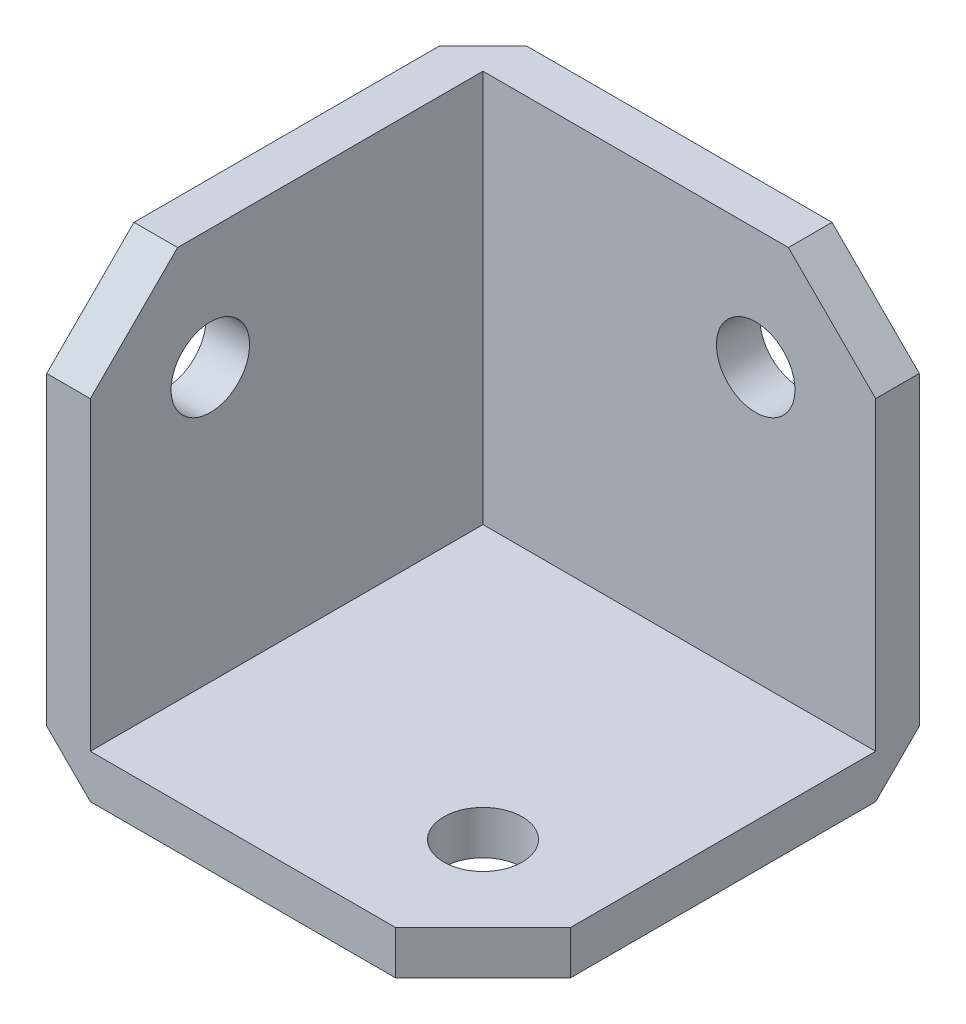
ISO-10303-21;
HEADER;
FILE_DESCRIPTION(('STEP AP214'),'2;1');
FILE_NAME('part.step','',(''),(''),'','','');
FILE_SCHEMA(('AUTOMOTIVE_DESIGN { 1 0 10303 214 1 1 1 1 }'));
ENDSEC;
DATA;
#1=APPLICATION_CONTEXT('core data for automotive mechanical design processes');
#2=APPLICATION_PROTOCOL_DEFINITION('international standard','automotive_design',2000,#1);
#3=PRODUCT_CONTEXT('',#1,'mechanical');
#4=PRODUCT('Part','Part','',(#3));
#5=PRODUCT_RELATED_PRODUCT_CATEGORY('part','',(#4));
#6=PRODUCT_DEFINITION_FORMATION('','',#4);
#7=PRODUCT_DEFINITION_CONTEXT('part definition',#1,'design');
#8=PRODUCT_DEFINITION('design','',#6,#7);
#9=PRODUCT_DEFINITION_SHAPE('','',#8);
#10=(LENGTH_UNIT() NAMED_UNIT(*) SI_UNIT(.MILLI.,.METRE.));
#11=(NAMED_UNIT(*) PLANE_ANGLE_UNIT() SI_UNIT($,.RADIAN.));
#12=(NAMED_UNIT(*) SI_UNIT($,.STERADIAN.) SOLID_ANGLE_UNIT());
#13=UNCERTAINTY_MEASURE_WITH_UNIT(LENGTH_MEASURE(1.E-05),#10,'distance_accuracy_value','');
#14=(GEOMETRIC_REPRESENTATION_CONTEXT(3) GLOBAL_UNCERTAINTY_ASSIGNED_CONTEXT((#13)) GLOBAL_UNIT_ASSIGNED_CONTEXT((#10,
#11,#12)) REPRESENTATION_CONTEXT('',''));
#15=CARTESIAN_POINT('',(0.,0.,0.));
#16=DIRECTION('',(0.,0.,1.));
#17=DIRECTION('',(1.,0.,0.));
#18=AXIS2_PLACEMENT_3D('',#15,#16,#17);
#19=CARTESIAN_POINT('',(0.,0.,25.4));
#20=DIRECTION('',(1.,0.,0.));
#21=DIRECTION('',(0.,0.,-1.));
#22=AXIS2_PLACEMENT_3D('',#19,#20,#21);
#23=PLANE('',#22);
#24=CARTESIAN_POINT('',(0.,18.415,18.415));
#25=DIRECTION('',(1.,0.,0.));
#26=DIRECTION('',(0.,1.,0.));
#27=AXIS2_PLACEMENT_3D('',#24,#25,#26);
#28=CIRCLE('',#27,2.286);
#29=CARTESIAN_POINT('',(0.,20.701,18.415));
#30=VERTEX_POINT('',#29);
#31=EDGE_CURVE('E281',#30,#30,#28,.T.);
#32=ORIENTED_EDGE('',*,*,#31,.T.);
#33=EDGE_LOOP('',(#32));
#34=FACE_BOUND('',#33,.T.);
#35=DIRECTION('',(0.,-1.,0.));
#36=VECTOR('',#35,1.);
#37=CARTESIAN_POINT('',(0.,0.,2.54));
#38=LINE('',#37,#36);
#39=CARTESIAN_POINT('',(0.,25.4,2.54));
#40=VERTEX_POINT('',#39);
#41=CARTESIAN_POINT('',(0.,2.54000000000001,2.54));
#42=VERTEX_POINT('',#41);
#43=EDGE_CURVE('E241',#40,#42,#38,.T.);
#44=ORIENTED_EDGE('',*,*,#43,.T.);
#45=DIRECTION('',(0.,0.,1.));
#46=VECTOR('',#45,1.);
#47=CARTESIAN_POINT('',(0.,2.54000000000001,25.4));
#48=LINE('',#47,#46);
#49=CARTESIAN_POINT('',(0.,2.54000000000001,25.4));
#50=VERTEX_POINT('',#49);
#51=EDGE_CURVE('E244',#42,#50,#48,.T.);
#52=ORIENTED_EDGE('',*,*,#51,.T.);
#53=DIRECTION('',(0.,-1.,0.));
#54=VECTOR('',#53,1.);
#55=CARTESIAN_POINT('',(0.,0.,25.4));
#56=LINE('',#55,#54);
#57=CARTESIAN_POINT('',(0.,20.32,25.4));
#58=VERTEX_POINT('',#57);
#59=EDGE_CURVE('E176',#58,#50,#56,.T.);
#60=ORIENTED_EDGE('',*,*,#59,.F.);
#61=DIRECTION('',(0.,-0.707106781186546,0.707106781186549));
#62=VECTOR('',#61,1.);
#63=CARTESIAN_POINT('',(0.,20.32,25.4));
#64=LINE('',#63,#62);
#65=CARTESIAN_POINT('',(0.,25.4,20.32));
#66=VERTEX_POINT('',#65);
#67=EDGE_CURVE('E228',#58,#66,#64,.F.);
#68=ORIENTED_EDGE('',*,*,#67,.T.);
#69=DIRECTION('',(0.,0.,-1.));
#70=VECTOR('',#69,1.);
#71=CARTESIAN_POINT('',(0.,25.4,25.4));
#72=LINE('',#71,#70);
#73=EDGE_CURVE('E184',#66,#40,#72,.T.);
#74=ORIENTED_EDGE('',*,*,#73,.T.);
#75=EDGE_LOOP('',(#44,#52,#60,#68,#74));
#76=FACE_BOUND('',#75,.T.);
#77=ADVANCED_FACE('F41',(#34,#76),#23,.F.);
#78=CARTESIAN_POINT('',(0.,0.,25.4));
#79=DIRECTION('',(0.,1.,0.));
#80=DIRECTION('',(0.,0.,1.));
#81=AXIS2_PLACEMENT_3D('',#78,#79,#80);
#82=PLANE('',#81);
#83=CARTESIAN_POINT('',(18.415,0.,18.415));
#84=DIRECTION('',(0.,1.,0.));
#85=DIRECTION('',(-1.,0.,0.));
#86=AXIS2_PLACEMENT_3D('',#83,#84,#85);
#87=CIRCLE('',#86,2.286);
#88=CARTESIAN_POINT('',(16.129,0.,18.415));
#89=VERTEX_POINT('',#88);
#90=EDGE_CURVE('E272',#89,#89,#87,.T.);
#91=ORIENTED_EDGE('',*,*,#90,.T.);
#92=EDGE_LOOP('',(#91));
#93=FACE_BOUND('',#92,.T.);
#94=DIRECTION('',(1.,0.,0.));
#95=VECTOR('',#94,1.);
#96=CARTESIAN_POINT('',(0.,0.,25.4));
#97=LINE('',#96,#95);
#98=CARTESIAN_POINT('',(2.54,0.,25.4));
#99=VERTEX_POINT('',#98);
#100=CARTESIAN_POINT('',(20.32,0.,25.4));
#101=VERTEX_POINT('',#100);
#102=EDGE_CURVE('E180',#99,#101,#97,.T.);
#103=ORIENTED_EDGE('',*,*,#102,.F.);
#104=DIRECTION('',(0.,0.,-1.));
#105=VECTOR('',#104,1.);
#106=CARTESIAN_POINT('',(2.54,0.,25.4));
#107=LINE('',#106,#105);
#108=CARTESIAN_POINT('',(2.54,0.,2.54));
#109=VERTEX_POINT('',#108);
#110=EDGE_CURVE('E237',#99,#109,#107,.T.);
#111=ORIENTED_EDGE('',*,*,#110,.T.);
#112=DIRECTION('',(1.,0.,0.));
#113=VECTOR('',#112,1.);
#114=CARTESIAN_POINT('',(25.4,0.,2.54));
#115=LINE('',#114,#113);
#116=CARTESIAN_POINT('',(25.4,0.,2.54));
#117=VERTEX_POINT('',#116);
#118=EDGE_CURVE('E234',#109,#117,#115,.T.);
#119=ORIENTED_EDGE('',*,*,#118,.T.);
#120=DIRECTION('',(0.,0.,-1.));
#121=VECTOR('',#120,1.);
#122=CARTESIAN_POINT('',(25.4,0.,25.4));
#123=LINE('',#122,#121);
#124=CARTESIAN_POINT('',(25.4,0.,20.32));
#125=VERTEX_POINT('',#124);
#126=EDGE_CURVE('E193',#125,#117,#123,.T.);
#127=ORIENTED_EDGE('',*,*,#126,.F.);
#128=DIRECTION('',(0.707106781186546,0.,-0.707106781186549));
#129=VECTOR('',#128,1.);
#130=CARTESIAN_POINT('',(20.32,0.,25.4));
#131=LINE('',#130,#129);
#132=EDGE_CURVE('E213',#125,#101,#131,.F.);
#133=ORIENTED_EDGE('',*,*,#132,.T.);
#134=EDGE_LOOP('',(#103,#111,#119,#127,#133));
#135=FACE_BOUND('',#134,.T.);
#136=ADVANCED_FACE('F317',(#93,#135),#82,.F.);
#137=CARTESIAN_POINT('',(25.4,0.,25.4));
#138=DIRECTION('',(-1.,0.,0.));
#139=DIRECTION('',(0.,0.,1.));
#140=AXIS2_PLACEMENT_3D('',#137,#138,#139);
#141=PLANE('',#140);
#142=ORIENTED_EDGE('',*,*,#126,.T.);
#143=DIRECTION('',(0.,0.707106781186549,-0.707106781186546));
#144=VECTOR('',#143,1.);
#145=CARTESIAN_POINT('',(25.4,0.,2.54));
#146=LINE('',#145,#144);
#147=CARTESIAN_POINT('',(25.4,2.54000000000001,0.));
#148=VERTEX_POINT('',#147);
#149=EDGE_CURVE('E11',#117,#148,#146,.T.);
#150=ORIENTED_EDGE('',*,*,#149,.T.);
#151=DIRECTION('',(0.,1.,0.));
#152=VECTOR('',#151,1.);
#153=CARTESIAN_POINT('',(25.4,0.,0.));
#154=LINE('',#153,#152);
#155=CARTESIAN_POINT('',(25.4,20.32,0.));
#156=VERTEX_POINT('',#155);
#157=EDGE_CURVE('E185',#148,#156,#154,.T.);
#158=ORIENTED_EDGE('',*,*,#157,.T.);
#159=DIRECTION('',(0.,0.,1.));
#160=VECTOR('',#159,1.);
#161=CARTESIAN_POINT('',(25.4,20.32,25.4));
#162=LINE('',#161,#160);
#163=CARTESIAN_POINT('',(25.4,20.32,2.54));
#164=VERTEX_POINT('',#163);
#165=EDGE_CURVE('E207',#156,#164,#162,.T.);
#166=ORIENTED_EDGE('',*,*,#165,.T.);
#167=DIRECTION('',(0.,1.,0.));
#168=VECTOR('',#167,1.);
#169=CARTESIAN_POINT('',(25.4,25.4,2.54));
#170=LINE('',#169,#168);
#171=CARTESIAN_POINT('',(25.4,2.54,2.54));
#172=VERTEX_POINT('',#171);
#173=EDGE_CURVE('E150',#172,#164,#170,.T.);
#174=ORIENTED_EDGE('',*,*,#173,.F.);
#175=DIRECTION('',(0.,0.,1.));
#176=VECTOR('',#175,1.);
#177=CARTESIAN_POINT('',(25.4,2.54,2.54));
#178=LINE('',#177,#176);
#179=CARTESIAN_POINT('',(25.4,2.54,20.32));
#180=VERTEX_POINT('',#179);
#181=EDGE_CURVE('E171',#172,#180,#178,.T.);
#182=ORIENTED_EDGE('',*,*,#181,.T.);
#183=DIRECTION('',(0.,-1.,0.));
#184=VECTOR('',#183,1.);
#185=CARTESIAN_POINT('',(25.4,0.,20.32));
#186=LINE('',#185,#184);
#187=EDGE_CURVE('E210',#180,#125,#186,.T.);
#188=ORIENTED_EDGE('',*,*,#187,.T.);
#189=EDGE_LOOP('',(#142,#150,#158,#166,#174,#182,#188));
#190=FACE_BOUND('',#189,.T.);
#191=ADVANCED_FACE('F308',(#190),#141,.F.);
#192=CARTESIAN_POINT('',(0.,25.4,25.4));
#193=DIRECTION('',(0.,-1.,0.));
#194=DIRECTION('',(0.,0.,-1.));
#195=AXIS2_PLACEMENT_3D('',#192,#193,#194);
#196=PLANE('',#195);
#197=DIRECTION('',(-1.,0.,0.));
#198=VECTOR('',#197,1.);
#199=CARTESIAN_POINT('',(0.,25.4,0.));
#200=LINE('',#199,#198);
#201=CARTESIAN_POINT('',(20.32,25.4,0.));
#202=VERTEX_POINT('',#201);
#203=CARTESIAN_POINT('',(2.54000000000001,25.4,0.));
#204=VERTEX_POINT('',#203);
#205=EDGE_CURVE('E181',#202,#204,#200,.T.);
#206=ORIENTED_EDGE('',*,*,#205,.T.);
#207=DIRECTION('',(-0.707106781186549,0.,0.707106781186546));
#208=VECTOR('',#207,1.);
#209=CARTESIAN_POINT('',(0.,25.4,2.54));
#210=LINE('',#209,#208);
#211=EDGE_CURVE('E52',#204,#40,#210,.T.);
#212=ORIENTED_EDGE('',*,*,#211,.T.);
#213=ORIENTED_EDGE('',*,*,#73,.F.);
#214=DIRECTION('',(1.,0.,0.));
#215=VECTOR('',#214,1.);
#216=CARTESIAN_POINT('',(0.,25.4,20.32));
#217=LINE('',#216,#215);
#218=CARTESIAN_POINT('',(2.54,25.4,20.32));
#219=VERTEX_POINT('',#218);
#220=EDGE_CURVE('E166',#66,#219,#217,.T.);
#221=ORIENTED_EDGE('',*,*,#220,.T.);
#222=DIRECTION('',(0.,0.,1.));
#223=VECTOR('',#222,1.);
#224=CARTESIAN_POINT('',(2.54,25.4,2.54));
#225=LINE('',#224,#223);
#226=CARTESIAN_POINT('',(2.54,25.4,2.54));
#227=VERTEX_POINT('',#226);
#228=EDGE_CURVE('E155',#227,#219,#225,.T.);
#229=ORIENTED_EDGE('',*,*,#228,.F.);
#230=DIRECTION('',(-1.,0.,0.));
#231=VECTOR('',#230,1.);
#232=CARTESIAN_POINT('',(25.4,25.4,2.54));
#233=LINE('',#232,#231);
#234=CARTESIAN_POINT('',(20.32,25.4,2.54));
#235=VERTEX_POINT('',#234);
#236=EDGE_CURVE('E136',#235,#227,#233,.T.);
#237=ORIENTED_EDGE('',*,*,#236,.F.);
#238=DIRECTION('',(0.,0.,-1.));
#239=VECTOR('',#238,1.);
#240=CARTESIAN_POINT('',(20.32,25.4,25.4));
#241=LINE('',#240,#239);
#242=EDGE_CURVE('E219',#235,#202,#241,.T.);
#243=ORIENTED_EDGE('',*,*,#242,.T.);
#244=EDGE_LOOP('',(#206,#212,#213,#221,#229,#237,#243));
#245=FACE_BOUND('',#244,.T.);
#246=ADVANCED_FACE('F163',(#245),#196,.F.);
#247=CARTESIAN_POINT('',(0.,0.,25.4));
#248=DIRECTION('',(0.,0.,-1.));
#249=DIRECTION('',(-1.,0.,0.));
#250=AXIS2_PLACEMENT_3D('',#247,#248,#249);
#251=PLANE('',#250);
#252=ORIENTED_EDGE('',*,*,#59,.T.);
#253=DIRECTION('',(-0.707106781186546,0.707106781186549,0.));
#254=VECTOR('',#253,1.);
#255=CARTESIAN_POINT('',(2.54,0.,25.4));
#256=LINE('',#255,#254);
#257=EDGE_CURVE('E247',#50,#99,#256,.F.);
#258=ORIENTED_EDGE('',*,*,#257,.T.);
#259=ORIENTED_EDGE('',*,*,#102,.T.);
#260=DIRECTION('',(0.,1.,0.));
#261=VECTOR('',#260,1.);
#262=CARTESIAN_POINT('',(20.32,0.,25.4));
#263=LINE('',#262,#261);
#264=CARTESIAN_POINT('',(20.32,2.54,25.4));
#265=VERTEX_POINT('',#264);
#266=EDGE_CURVE('E200',#101,#265,#263,.T.);
#267=ORIENTED_EDGE('',*,*,#266,.T.);
#268=DIRECTION('',(1.,0.,0.));
#269=VECTOR('',#268,1.);
#270=CARTESIAN_POINT('',(25.4,2.54,25.4));
#271=LINE('',#270,#269);
#272=CARTESIAN_POINT('',(2.54,2.54,25.4));
#273=VERTEX_POINT('',#272);
#274=EDGE_CURVE('E298',#273,#265,#271,.T.);
#275=ORIENTED_EDGE('',*,*,#274,.F.);
#276=DIRECTION('',(0.,-1.,0.));
#277=VECTOR('',#276,1.);
#278=CARTESIAN_POINT('',(2.54,25.4,25.4));
#279=LINE('',#278,#277);
#280=CARTESIAN_POINT('',(2.54,20.32,25.4));
#281=VERTEX_POINT('',#280);
#282=EDGE_CURVE('E293',#281,#273,#279,.T.);
#283=ORIENTED_EDGE('',*,*,#282,.F.);
#284=DIRECTION('',(-1.,0.,0.));
#285=VECTOR('',#284,1.);
#286=CARTESIAN_POINT('',(0.,20.32,25.4));
#287=LINE('',#286,#285);
#288=EDGE_CURVE('E196',#281,#58,#287,.T.);
#289=ORIENTED_EDGE('',*,*,#288,.T.);
#290=EDGE_LOOP('',(#252,#258,#259,#267,#275,#283,#289));
#291=FACE_BOUND('',#290,.T.);
#292=ADVANCED_FACE('F382',(#291),#251,.F.);
#293=CARTESIAN_POINT('',(0.,0.,0.));
#294=DIRECTION('',(0.,0.,-1.));
#295=DIRECTION('',(-1.,0.,0.));
#296=AXIS2_PLACEMENT_3D('',#293,#294,#295);
#297=PLANE('',#296);
#298=CARTESIAN_POINT('',(18.415,18.415,0.));
#299=DIRECTION('',(0.,0.,1.));
#300=DIRECTION('',(1.,0.,0.));
#301=AXIS2_PLACEMENT_3D('',#298,#299,#300);
#302=CIRCLE('',#301,2.286);
#303=CARTESIAN_POINT('',(20.701,18.415,0.));
#304=VERTEX_POINT('',#303);
#305=EDGE_CURVE('E289',#304,#304,#302,.T.);
#306=ORIENTED_EDGE('',*,*,#305,.T.);
#307=EDGE_LOOP('',(#306));
#308=FACE_BOUND('',#307,.T.);
#309=DIRECTION('',(-1.,0.,0.));
#310=VECTOR('',#309,1.);
#311=CARTESIAN_POINT('',(0.,2.54000000000001,0.));
#312=LINE('',#311,#310);
#313=CARTESIAN_POINT('',(2.54000000000001,2.54000000000001,0.));
#314=VERTEX_POINT('',#313);
#315=EDGE_CURVE('E60',#148,#314,#312,.T.);
#316=ORIENTED_EDGE('',*,*,#315,.T.);
#317=DIRECTION('',(0.,1.,0.));
#318=VECTOR('',#317,1.);
#319=CARTESIAN_POINT('',(2.54000000000001,25.4,0.));
#320=LINE('',#319,#318);
#321=EDGE_CURVE('E252',#314,#204,#320,.T.);
#322=ORIENTED_EDGE('',*,*,#321,.T.);
#323=ORIENTED_EDGE('',*,*,#205,.F.);
#324=DIRECTION('',(-0.707106781186546,0.707106781186549,0.));
#325=VECTOR('',#324,1.);
#326=CARTESIAN_POINT('',(22.86,22.86,0.));
#327=LINE('',#326,#325);
#328=EDGE_CURVE('E222',#202,#156,#327,.F.);
#329=ORIENTED_EDGE('',*,*,#328,.T.);
#330=ORIENTED_EDGE('',*,*,#157,.F.);
#331=EDGE_LOOP('',(#316,#322,#323,#329,#330));
#332=FACE_BOUND('',#331,.T.);
#333=ADVANCED_FACE('F388',(#308,#332),#297,.T.);
#334=CARTESIAN_POINT('',(25.4,2.54,2.54));
#335=DIRECTION('',(0.,-1.,0.));
#336=DIRECTION('',(1.,0.,0.));
#337=AXIS2_PLACEMENT_3D('',#334,#335,#336);
#338=PLANE('',#337);
#339=CARTESIAN_POINT('',(18.415,2.54,18.415));
#340=DIRECTION('',(0.,1.,0.));
#341=DIRECTION('',(-1.,0.,0.));
#342=AXIS2_PLACEMENT_3D('',#339,#340,#341);
#343=CIRCLE('',#342,2.286);
#344=CARTESIAN_POINT('',(16.129,2.54,18.415));
#345=VERTEX_POINT('',#344);
#346=EDGE_CURVE('E267',#345,#345,#343,.T.);
#347=ORIENTED_EDGE('',*,*,#346,.F.);
#348=EDGE_LOOP('',(#347));
#349=FACE_BOUND('',#348,.T.);
#350=ORIENTED_EDGE('',*,*,#274,.T.);
#351=DIRECTION('',(-0.707106781186546,0.,0.707106781186549));
#352=VECTOR('',#351,1.);
#353=CARTESIAN_POINT('',(20.32,2.54,25.4));
#354=LINE('',#353,#352);
#355=EDGE_CURVE('E204',#265,#180,#354,.F.);
#356=ORIENTED_EDGE('',*,*,#355,.T.);
#357=ORIENTED_EDGE('',*,*,#181,.F.);
#358=DIRECTION('',(1.,0.,0.));
#359=VECTOR('',#358,1.);
#360=CARTESIAN_POINT('',(25.4,2.54,2.54));
#361=LINE('',#360,#359);
#362=CARTESIAN_POINT('',(2.54,2.54,2.54));
#363=VERTEX_POINT('',#362);
#364=EDGE_CURVE('E160',#363,#172,#361,.T.);
#365=ORIENTED_EDGE('',*,*,#364,.F.);
#366=DIRECTION('',(0.,0.,1.));
#367=VECTOR('',#366,1.);
#368=CARTESIAN_POINT('',(2.54,2.54,2.54));
#369=LINE('',#368,#367);
#370=EDGE_CURVE('E158',#363,#273,#369,.T.);
#371=ORIENTED_EDGE('',*,*,#370,.T.);
#372=EDGE_LOOP('',(#350,#356,#357,#365,#371));
#373=FACE_BOUND('',#372,.T.);
#374=ADVANCED_FACE('F384',(#349,#373),#338,.F.);
#375=CARTESIAN_POINT('',(2.54,25.4,2.54));
#376=DIRECTION('',(-1.,0.,0.));
#377=DIRECTION('',(0.,-1.,0.));
#378=AXIS2_PLACEMENT_3D('',#375,#376,#377);
#379=PLANE('',#378);
#380=CARTESIAN_POINT('',(2.54,18.415,18.415));
#381=DIRECTION('',(1.,0.,0.));
#382=DIRECTION('',(0.,1.,0.));
#383=AXIS2_PLACEMENT_3D('',#380,#381,#382);
#384=CIRCLE('',#383,2.286);
#385=CARTESIAN_POINT('',(2.54,20.701,18.415));
#386=VERTEX_POINT('',#385);
#387=EDGE_CURVE('E278',#386,#386,#384,.T.);
#388=ORIENTED_EDGE('',*,*,#387,.F.);
#389=EDGE_LOOP('',(#388));
#390=FACE_BOUND('',#389,.T.);
#391=ORIENTED_EDGE('',*,*,#228,.T.);
#392=DIRECTION('',(0.,0.707106781186546,-0.707106781186549));
#393=VECTOR('',#392,1.);
#394=CARTESIAN_POINT('',(2.54,20.32,25.4));
#395=LINE('',#394,#393);
#396=EDGE_CURVE('E231',#219,#281,#395,.F.);
#397=ORIENTED_EDGE('',*,*,#396,.T.);
#398=ORIENTED_EDGE('',*,*,#282,.T.);
#399=ORIENTED_EDGE('',*,*,#370,.F.);
#400=DIRECTION('',(0.,-1.,0.));
#401=VECTOR('',#400,1.);
#402=CARTESIAN_POINT('',(2.54,25.4,2.54));
#403=LINE('',#402,#401);
#404=EDGE_CURVE('E141',#227,#363,#403,.T.);
#405=ORIENTED_EDGE('',*,*,#404,.F.);
#406=EDGE_LOOP('',(#391,#397,#398,#399,#405));
#407=FACE_BOUND('',#406,.T.);
#408=ADVANCED_FACE('F154',(#390,#407),#379,.F.);
#409=CARTESIAN_POINT('',(0.,0.,2.54));
#410=DIRECTION('',(0.,0.,-1.));
#411=DIRECTION('',(-1.,0.,0.));
#412=AXIS2_PLACEMENT_3D('',#409,#410,#411);
#413=PLANE('',#412);
#414=CARTESIAN_POINT('',(18.415,18.415,2.54));
#415=DIRECTION('',(0.,0.,1.));
#416=DIRECTION('',(1.,0.,0.));
#417=AXIS2_PLACEMENT_3D('',#414,#415,#416);
#418=CIRCLE('',#417,2.286);
#419=CARTESIAN_POINT('',(20.701,18.415,2.54));
#420=VERTEX_POINT('',#419);
#421=EDGE_CURVE('E285',#420,#420,#418,.T.);
#422=ORIENTED_EDGE('',*,*,#421,.F.);
#423=EDGE_LOOP('',(#422));
#424=FACE_BOUND('',#423,.T.);
#425=ORIENTED_EDGE('',*,*,#173,.T.);
#426=DIRECTION('',(0.707106781186546,-0.707106781186549,0.));
#427=VECTOR('',#426,1.);
#428=CARTESIAN_POINT('',(20.32,25.4,2.54));
#429=LINE('',#428,#427);
#430=EDGE_CURVE('E144',#164,#235,#429,.F.);
#431=ORIENTED_EDGE('',*,*,#430,.T.);
#432=ORIENTED_EDGE('',*,*,#236,.T.);
#433=ORIENTED_EDGE('',*,*,#404,.T.);
#434=ORIENTED_EDGE('',*,*,#364,.T.);
#435=EDGE_LOOP('',(#425,#431,#432,#433,#434));
#436=FACE_BOUND('',#435,.T.);
#437=ADVANCED_FACE('F139',(#424,#436),#413,.F.);
#438=CARTESIAN_POINT('',(18.415,18.415,0.));
#439=DIRECTION('',(0.,0.,1.));
#440=DIRECTION('',(1.,0.,0.));
#441=AXIS2_PLACEMENT_3D('',#438,#439,#440);
#442=CYLINDRICAL_SURFACE('',#441,2.286);
#443=ORIENTED_EDGE('',*,*,#305,.F.);
#444=EDGE_LOOP('',(#443));
#445=FACE_BOUND('',#444,.T.);
#446=ORIENTED_EDGE('',*,*,#421,.T.);
#447=EDGE_LOOP('',(#446));
#448=FACE_BOUND('',#447,.T.);
#449=ADVANCED_FACE('F478',(#445,#448),#442,.F.);
#450=CARTESIAN_POINT('',(0.,18.415,18.415));
#451=DIRECTION('',(1.,0.,0.));
#452=DIRECTION('',(0.,1.,0.));
#453=AXIS2_PLACEMENT_3D('',#450,#451,#452);
#454=CYLINDRICAL_SURFACE('',#453,2.286);
#455=ORIENTED_EDGE('',*,*,#31,.F.);
#456=EDGE_LOOP('',(#455));
#457=FACE_BOUND('',#456,.T.);
#458=ORIENTED_EDGE('',*,*,#387,.T.);
#459=EDGE_LOOP('',(#458));
#460=FACE_BOUND('',#459,.T.);
#461=ADVANCED_FACE('F468',(#457,#460),#454,.F.);
#462=CARTESIAN_POINT('',(18.415,0.,18.415));
#463=DIRECTION('',(0.,1.,0.));
#464=DIRECTION('',(-1.,0.,0.));
#465=AXIS2_PLACEMENT_3D('',#462,#463,#464);
#466=CYLINDRICAL_SURFACE('',#465,2.286);
#467=ORIENTED_EDGE('',*,*,#90,.F.);
#468=EDGE_LOOP('',(#467));
#469=FACE_BOUND('',#468,.T.);
#470=ORIENTED_EDGE('',*,*,#346,.T.);
#471=EDGE_LOOP('',(#470));
#472=FACE_BOUND('',#471,.T.);
#473=ADVANCED_FACE('F353',(#469,#472),#466,.F.);
#474=CARTESIAN_POINT('',(20.32,0.,25.4));
#475=DIRECTION('',(-0.707106781186549,0.,-0.707106781186546));
#476=DIRECTION('',(0.,1.,0.));
#477=AXIS2_PLACEMENT_3D('',#474,#475,#476);
#478=PLANE('',#477);
#479=ORIENTED_EDGE('',*,*,#132,.F.);
#480=ORIENTED_EDGE('',*,*,#187,.F.);
#481=ORIENTED_EDGE('',*,*,#355,.F.);
#482=ORIENTED_EDGE('',*,*,#266,.F.);
#483=EDGE_LOOP('',(#479,#480,#481,#482));
#484=FACE_BOUND('',#483,.T.);
#485=ADVANCED_FACE('F313',(#484),#478,.F.);
#486=CARTESIAN_POINT('',(20.32,25.4,25.4));
#487=DIRECTION('',(-0.707106781186549,-0.707106781186546,0.));
#488=DIRECTION('',(0.,0.,-1.));
#489=AXIS2_PLACEMENT_3D('',#486,#487,#488);
#490=PLANE('',#489);
#491=ORIENTED_EDGE('',*,*,#430,.F.);
#492=ORIENTED_EDGE('',*,*,#165,.F.);
#493=ORIENTED_EDGE('',*,*,#328,.F.);
#494=ORIENTED_EDGE('',*,*,#242,.F.);
#495=EDGE_LOOP('',(#491,#492,#493,#494));
#496=FACE_BOUND('',#495,.T.);
#497=ADVANCED_FACE('F352',(#496),#490,.F.);
#498=CARTESIAN_POINT('',(0.,20.32,25.4));
#499=DIRECTION('',(0.,-0.707106781186549,-0.707106781186546));
#500=DIRECTION('',(-1.,0.,0.));
#501=AXIS2_PLACEMENT_3D('',#498,#499,#500);
#502=PLANE('',#501);
#503=ORIENTED_EDGE('',*,*,#396,.F.);
#504=ORIENTED_EDGE('',*,*,#220,.F.);
#505=ORIENTED_EDGE('',*,*,#67,.F.);
#506=ORIENTED_EDGE('',*,*,#288,.F.);
#507=EDGE_LOOP('',(#503,#504,#505,#506));
#508=FACE_BOUND('',#507,.T.);
#509=ADVANCED_FACE('F359',(#508),#502,.F.);
#510=CARTESIAN_POINT('',(0.,0.,2.54));
#511=DIRECTION('',(0.,-0.707106781186546,-0.707106781186549));
#512=DIRECTION('',(-1.,0.,0.));
#513=AXIS2_PLACEMENT_3D('',#510,#511,#512);
#514=PLANE('',#513);
#515=ORIENTED_EDGE('',*,*,#149,.F.);
#516=ORIENTED_EDGE('',*,*,#118,.F.);
#517=DIRECTION('',(0.,-0.707106781186549,0.707106781186546));
#518=VECTOR('',#517,1.);
#519=CARTESIAN_POINT('',(2.54,0.,2.54));
#520=LINE('',#519,#518);
#521=EDGE_CURVE('E46',#314,#109,#520,.T.);
#522=ORIENTED_EDGE('',*,*,#521,.F.);
#523=ORIENTED_EDGE('',*,*,#315,.F.);
#524=EDGE_LOOP('',(#515,#516,#522,#523));
#525=FACE_BOUND('',#524,.T.);
#526=ADVANCED_FACE('F44',(#525),#514,.T.);
#527=CARTESIAN_POINT('',(0.,0.,2.54));
#528=DIRECTION('',(-0.707106781186546,0.,-0.707106781186549));
#529=DIRECTION('',(0.,1.,0.));
#530=AXIS2_PLACEMENT_3D('',#527,#528,#529);
#531=PLANE('',#530);
#532=ORIENTED_EDGE('',*,*,#211,.F.);
#533=ORIENTED_EDGE('',*,*,#321,.F.);
#534=DIRECTION('',(0.707106781186549,0.,-0.707106781186546));
#535=VECTOR('',#534,1.);
#536=CARTESIAN_POINT('',(1.27000000000001,2.54000000000001,1.27));
#537=LINE('',#536,#535);
#538=EDGE_CURVE('E259',#42,#314,#537,.T.);
#539=ORIENTED_EDGE('',*,*,#538,.F.);
#540=ORIENTED_EDGE('',*,*,#43,.F.);
#541=EDGE_LOOP('',(#532,#533,#539,#540));
#542=FACE_BOUND('',#541,.T.);
#543=ADVANCED_FACE('F326',(#542),#531,.T.);
#544=CARTESIAN_POINT('',(2.54,0.,2.54));
#545=DIRECTION('',(-0.577350269189626,-0.577350269189623,-0.577350269189628));
#546=DIRECTION('',(-0.707106781186549,0.,0.707106781186546));
#547=AXIS2_PLACEMENT_3D('',#544,#545,#546);
#548=PLANE('',#547);
#549=ORIENTED_EDGE('',*,*,#538,.T.);
#550=ORIENTED_EDGE('',*,*,#521,.T.);
#551=DIRECTION('',(0.707106781186546,-0.707106781186549,0.));
#552=VECTOR('',#551,1.);
#553=CARTESIAN_POINT('',(2.54,0.,2.54));
#554=LINE('',#553,#552);
#555=EDGE_CURVE('E257',#42,#109,#554,.T.);
#556=ORIENTED_EDGE('',*,*,#555,.F.);
#557=EDGE_LOOP('',(#549,#550,#556));
#558=FACE_BOUND('',#557,.T.);
#559=ADVANCED_FACE('F324',(#558),#548,.T.);
#560=CARTESIAN_POINT('',(2.54,0.,25.4));
#561=DIRECTION('',(0.707106781186549,0.707106781186546,0.));
#562=DIRECTION('',(0.,0.,-1.));
#563=AXIS2_PLACEMENT_3D('',#560,#561,#562);
#564=PLANE('',#563);
#565=ORIENTED_EDGE('',*,*,#257,.F.);
#566=ORIENTED_EDGE('',*,*,#51,.F.);
#567=ORIENTED_EDGE('',*,*,#555,.T.);
#568=ORIENTED_EDGE('',*,*,#110,.F.);
#569=EDGE_LOOP('',(#565,#566,#567,#568));
#570=FACE_BOUND('',#569,.T.);
#571=ADVANCED_FACE('F322',(#570),#564,.F.);
#572=CLOSED_SHELL('',(#77,#136,#191,#246,#292,#333,#374,#408,#437,#449,#461,#473,#485,#497,#509,
#526,#543,#559,#571));
#573=MANIFOLD_SOLID_BREP('B2',#572);
#574=ADVANCED_BREP_SHAPE_REPRESENTATION('',(#18,#573),#14);
#575=SHAPE_DEFINITION_REPRESENTATION(#9,#574);
ENDSEC;
END-ISO-10303-21;
